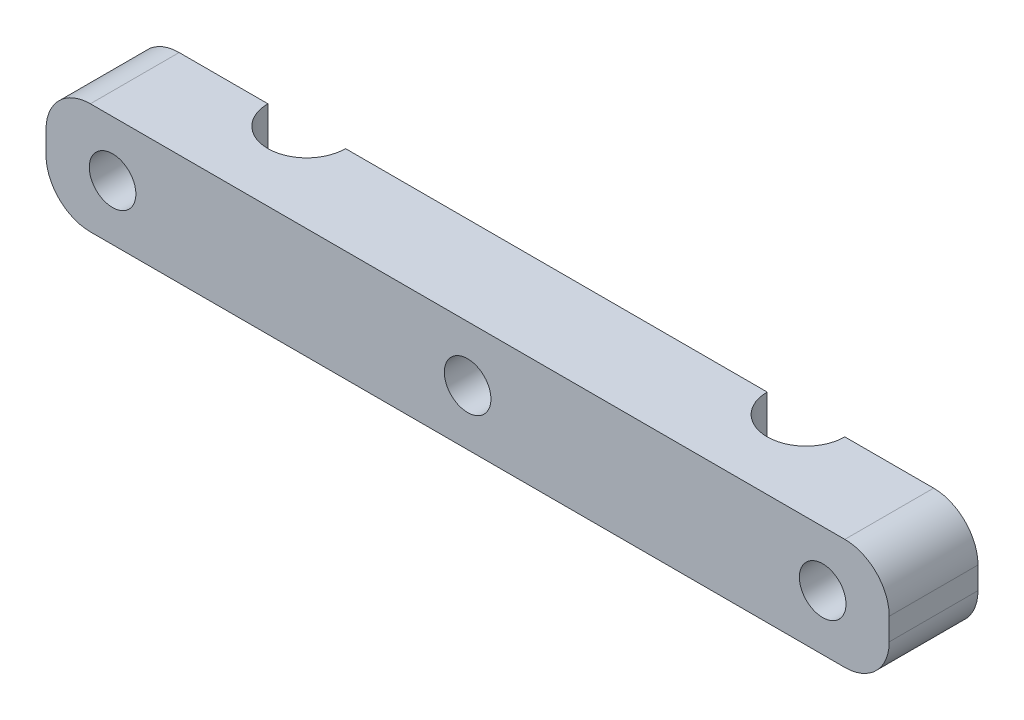
ISO-10303-21;
HEADER;
FILE_DESCRIPTION(('STEP AP214'),'2;1');
FILE_NAME('part.step','',(''),(''),'','','');
FILE_SCHEMA(('AUTOMOTIVE_DESIGN { 1 0 10303 214 1 1 1 1 }'));
ENDSEC;
DATA;
#1=APPLICATION_CONTEXT('core data for automotive mechanical design processes');
#2=APPLICATION_PROTOCOL_DEFINITION('international standard','automotive_design',2000,#1);
#3=PRODUCT_CONTEXT('',#1,'mechanical');
#4=PRODUCT('Part','Part','',(#3));
#5=PRODUCT_RELATED_PRODUCT_CATEGORY('part','',(#4));
#6=PRODUCT_DEFINITION_FORMATION('','',#4);
#7=PRODUCT_DEFINITION_CONTEXT('part definition',#1,'design');
#8=PRODUCT_DEFINITION('design','',#6,#7);
#9=PRODUCT_DEFINITION_SHAPE('','',#8);
#10=(LENGTH_UNIT() NAMED_UNIT(*) SI_UNIT(.MILLI.,.METRE.));
#11=(NAMED_UNIT(*) PLANE_ANGLE_UNIT() SI_UNIT($,.RADIAN.));
#12=(NAMED_UNIT(*) SI_UNIT($,.STERADIAN.) SOLID_ANGLE_UNIT());
#13=UNCERTAINTY_MEASURE_WITH_UNIT(LENGTH_MEASURE(1.E-05),#10,'distance_accuracy_value','');
#14=(GEOMETRIC_REPRESENTATION_CONTEXT(3) GLOBAL_UNCERTAINTY_ASSIGNED_CONTEXT((#13)) GLOBAL_UNIT_ASSIGNED_CONTEXT((#10,
#11,#12)) REPRESENTATION_CONTEXT('',''));
#15=CARTESIAN_POINT('',(0.,0.,0.));
#16=DIRECTION('',(0.,0.,1.));
#17=DIRECTION('',(1.,0.,0.));
#18=AXIS2_PLACEMENT_3D('',#15,#16,#17);
#19=CARTESIAN_POINT('',(-38.,10.,8.));
#20=DIRECTION('',(1.,0.,0.));
#21=DIRECTION('',(0.,0.,-1.));
#22=AXIS2_PLACEMENT_3D('',#19,#20,#21);
#23=PLANE('',#22);
#24=DIRECTION('',(0.,-1.,0.));
#25=VECTOR('',#24,1.);
#26=CARTESIAN_POINT('',(-38.,10.,0.));
#27=LINE('',#26,#25);
#28=CARTESIAN_POINT('',(-38.,6.,0.));
#29=VERTEX_POINT('',#28);
#30=CARTESIAN_POINT('',(-38.,4.,0.));
#31=VERTEX_POINT('',#30);
#32=EDGE_CURVE('E157',#29,#31,#27,.T.);
#33=ORIENTED_EDGE('',*,*,#32,.T.);
#34=DIRECTION('',(0.,0.,1.));
#35=VECTOR('',#34,1.);
#36=CARTESIAN_POINT('',(-38.,4.,8.));
#37=LINE('',#36,#35);
#38=CARTESIAN_POINT('',(-38.,4.,8.));
#39=VERTEX_POINT('',#38);
#40=EDGE_CURVE('E212',#31,#39,#37,.T.);
#41=ORIENTED_EDGE('',*,*,#40,.T.);
#42=DIRECTION('',(0.,-1.,0.));
#43=VECTOR('',#42,1.);
#44=CARTESIAN_POINT('',(-38.,10.,8.));
#45=LINE('',#44,#43);
#46=CARTESIAN_POINT('',(-38.,6.,8.));
#47=VERTEX_POINT('',#46);
#48=EDGE_CURVE('E183',#47,#39,#45,.T.);
#49=ORIENTED_EDGE('',*,*,#48,.F.);
#50=DIRECTION('',(0.,0.,1.));
#51=VECTOR('',#50,1.);
#52=CARTESIAN_POINT('',(-38.,6.,8.));
#53=LINE('',#52,#51);
#54=EDGE_CURVE('E52',#47,#29,#53,.F.);
#55=ORIENTED_EDGE('',*,*,#54,.T.);
#56=EDGE_LOOP('',(#33,#41,#49,#55));
#57=FACE_BOUND('',#56,.T.);
#58=ADVANCED_FACE('F32',(#57),#23,.F.);
#59=CARTESIAN_POINT('',(-38.,10.,8.));
#60=DIRECTION('',(0.,0.,-1.));
#61=DIRECTION('',(-1.,0.,0.));
#62=AXIS2_PLACEMENT_3D('',#59,#60,#61);
#63=PLANE('',#62);
#64=CARTESIAN_POINT('',(-32.,5.,8.));
#65=DIRECTION('',(0.,0.,-1.));
#66=DIRECTION('',(-1.,0.,0.));
#67=AXIS2_PLACEMENT_3D('',#64,#65,#66);
#68=CIRCLE('',#67,2.1);
#69=CARTESIAN_POINT('',(-34.1,5.,8.));
#70=VERTEX_POINT('',#69);
#71=EDGE_CURVE('E161',#70,#70,#68,.T.);
#72=ORIENTED_EDGE('',*,*,#71,.T.);
#73=EDGE_LOOP('',(#72));
#74=FACE_BOUND('',#73,.T.);
#75=CARTESIAN_POINT('',(0.,5.,8.));
#76=DIRECTION('',(0.,0.,-1.));
#77=DIRECTION('',(-1.,0.,0.));
#78=AXIS2_PLACEMENT_3D('',#75,#76,#77);
#79=CIRCLE('',#78,2.1);
#80=CARTESIAN_POINT('',(-2.1,5.,8.));
#81=VERTEX_POINT('',#80);
#82=EDGE_CURVE('E255',#81,#81,#79,.T.);
#83=ORIENTED_EDGE('',*,*,#82,.T.);
#84=EDGE_LOOP('',(#83));
#85=FACE_BOUND('',#84,.T.);
#86=CARTESIAN_POINT('',(32.,5.,8.));
#87=DIRECTION('',(0.,0.,-1.));
#88=DIRECTION('',(1.,0.,0.));
#89=AXIS2_PLACEMENT_3D('',#86,#87,#88);
#90=CIRCLE('',#89,2.1);
#91=CARTESIAN_POINT('',(34.1,5.,8.));
#92=VERTEX_POINT('',#91);
#93=EDGE_CURVE('E249',#92,#92,#90,.T.);
#94=ORIENTED_EDGE('',*,*,#93,.T.);
#95=EDGE_LOOP('',(#94));
#96=FACE_BOUND('',#95,.T.);
#97=DIRECTION('',(1.,0.,0.));
#98=VECTOR('',#97,1.);
#99=CARTESIAN_POINT('',(-38.,0.,8.));
#100=LINE('',#99,#98);
#101=CARTESIAN_POINT('',(-34.,0.,8.));
#102=VERTEX_POINT('',#101);
#103=CARTESIAN_POINT('',(34.,0.,8.));
#104=VERTEX_POINT('',#103);
#105=EDGE_CURVE('E158',#102,#104,#100,.T.);
#106=ORIENTED_EDGE('',*,*,#105,.T.);
#107=CARTESIAN_POINT('',(34.,4.,8.));
#108=DIRECTION('',(0.,0.,-1.));
#109=DIRECTION('',(-1.,0.,0.));
#110=AXIS2_PLACEMENT_3D('',#107,#108,#109);
#111=CIRCLE('',#110,4.);
#112=CARTESIAN_POINT('',(38.,4.,8.));
#113=VERTEX_POINT('',#112);
#114=EDGE_CURVE('E205',#104,#113,#111,.F.);
#115=ORIENTED_EDGE('',*,*,#114,.T.);
#116=DIRECTION('',(0.,-1.,0.));
#117=VECTOR('',#116,1.);
#118=CARTESIAN_POINT('',(38.,10.,8.));
#119=LINE('',#118,#117);
#120=CARTESIAN_POINT('',(38.,6.,8.));
#121=VERTEX_POINT('',#120);
#122=EDGE_CURVE('E180',#121,#113,#119,.T.);
#123=ORIENTED_EDGE('',*,*,#122,.F.);
#124=CARTESIAN_POINT('',(34.,6.,8.));
#125=DIRECTION('',(0.,0.,-1.));
#126=DIRECTION('',(-1.,0.,0.));
#127=AXIS2_PLACEMENT_3D('',#124,#125,#126);
#128=CIRCLE('',#127,4.);
#129=CARTESIAN_POINT('',(34.,10.,8.));
#130=VERTEX_POINT('',#129);
#131=EDGE_CURVE('E203',#121,#130,#128,.F.);
#132=ORIENTED_EDGE('',*,*,#131,.T.);
#133=DIRECTION('',(1.,0.,0.));
#134=VECTOR('',#133,1.);
#135=CARTESIAN_POINT('',(-38.,10.,8.));
#136=LINE('',#135,#134);
#137=CARTESIAN_POINT('',(-34.,10.,8.));
#138=VERTEX_POINT('',#137);
#139=EDGE_CURVE('E131',#138,#130,#136,.T.);
#140=ORIENTED_EDGE('',*,*,#139,.F.);
#141=CARTESIAN_POINT('',(-34.,6.,8.));
#142=DIRECTION('',(0.,0.,-1.));
#143=DIRECTION('',(-1.,0.,0.));
#144=AXIS2_PLACEMENT_3D('',#141,#142,#143);
#145=CIRCLE('',#144,4.);
#146=EDGE_CURVE('E199',#138,#47,#145,.F.);
#147=ORIENTED_EDGE('',*,*,#146,.T.);
#148=ORIENTED_EDGE('',*,*,#48,.T.);
#149=CARTESIAN_POINT('',(-34.,4.,8.));
#150=DIRECTION('',(0.,0.,-1.));
#151=DIRECTION('',(-1.,0.,0.));
#152=AXIS2_PLACEMENT_3D('',#149,#150,#151);
#153=CIRCLE('',#152,4.);
#154=EDGE_CURVE('E201',#39,#102,#153,.F.);
#155=ORIENTED_EDGE('',*,*,#154,.T.);
#156=EDGE_LOOP('',(#106,#115,#123,#132,#140,#147,#148,#155));
#157=FACE_BOUND('',#156,.T.);
#158=ADVANCED_FACE('F223',(#74,#85,#96,#157),#63,.F.);
#159=CARTESIAN_POINT('',(38.,10.,8.));
#160=DIRECTION('',(-1.,0.,0.));
#161=DIRECTION('',(0.,0.,1.));
#162=AXIS2_PLACEMENT_3D('',#159,#160,#161);
#163=PLANE('',#162);
#164=ORIENTED_EDGE('',*,*,#122,.T.);
#165=DIRECTION('',(0.,0.,-1.));
#166=VECTOR('',#165,1.);
#167=CARTESIAN_POINT('',(38.,4.,0.));
#168=LINE('',#167,#166);
#169=CARTESIAN_POINT('',(38.,4.,0.));
#170=VERTEX_POINT('',#169);
#171=EDGE_CURVE('E188',#113,#170,#168,.T.);
#172=ORIENTED_EDGE('',*,*,#171,.T.);
#173=DIRECTION('',(0.,-1.,0.));
#174=VECTOR('',#173,1.);
#175=CARTESIAN_POINT('',(38.,10.,0.));
#176=LINE('',#175,#174);
#177=CARTESIAN_POINT('',(38.,6.,0.));
#178=VERTEX_POINT('',#177);
#179=EDGE_CURVE('E141',#178,#170,#176,.T.);
#180=ORIENTED_EDGE('',*,*,#179,.F.);
#181=DIRECTION('',(0.,0.,-1.));
#182=VECTOR('',#181,1.);
#183=CARTESIAN_POINT('',(38.,6.,8.));
#184=LINE('',#183,#182);
#185=EDGE_CURVE('E186',#178,#121,#184,.F.);
#186=ORIENTED_EDGE('',*,*,#185,.T.);
#187=EDGE_LOOP('',(#164,#172,#180,#186));
#188=FACE_BOUND('',#187,.T.);
#189=ADVANCED_FACE('F240',(#188),#163,.F.);
#190=CARTESIAN_POINT('',(26.,10.,0.));
#191=DIRECTION('',(0.,0.,1.));
#192=DIRECTION('',(1.,0.,0.));
#193=AXIS2_PLACEMENT_3D('',#190,#191,#192);
#194=PLANE('',#193);
#195=CARTESIAN_POINT('',(32.,5.,0.));
#196=DIRECTION('',(0.,0.,-1.));
#197=DIRECTION('',(1.,0.,0.));
#198=AXIS2_PLACEMENT_3D('',#195,#196,#197);
#199=CIRCLE('',#198,2.1);
#200=CARTESIAN_POINT('',(34.1,5.,0.));
#201=VERTEX_POINT('',#200);
#202=EDGE_CURVE('E246',#201,#201,#199,.T.);
#203=ORIENTED_EDGE('',*,*,#202,.F.);
#204=EDGE_LOOP('',(#203));
#205=FACE_BOUND('',#204,.T.);
#206=ORIENTED_EDGE('',*,*,#179,.T.);
#207=CARTESIAN_POINT('',(34.,4.,0.));
#208=DIRECTION('',(0.,0.,1.));
#209=DIRECTION('',(1.,0.,0.));
#210=AXIS2_PLACEMENT_3D('',#207,#208,#209);
#211=CIRCLE('',#210,4.);
#212=CARTESIAN_POINT('',(34.,0.,0.));
#213=VERTEX_POINT('',#212);
#214=EDGE_CURVE('E193',#170,#213,#211,.F.);
#215=ORIENTED_EDGE('',*,*,#214,.T.);
#216=DIRECTION('',(-1.,0.,0.));
#217=VECTOR('',#216,1.);
#218=CARTESIAN_POINT('',(26.,0.,0.));
#219=LINE('',#218,#217);
#220=CARTESIAN_POINT('',(26.,0.,0.));
#221=VERTEX_POINT('',#220);
#222=EDGE_CURVE('E138',#213,#221,#219,.T.);
#223=ORIENTED_EDGE('',*,*,#222,.T.);
#224=DIRECTION('',(0.,-1.,0.));
#225=VECTOR('',#224,1.);
#226=CARTESIAN_POINT('',(26.,10.,0.));
#227=LINE('',#226,#225);
#228=CARTESIAN_POINT('',(26.,10.,0.));
#229=VERTEX_POINT('',#228);
#230=EDGE_CURVE('E134',#229,#221,#227,.T.);
#231=ORIENTED_EDGE('',*,*,#230,.F.);
#232=DIRECTION('',(-1.,0.,0.));
#233=VECTOR('',#232,1.);
#234=CARTESIAN_POINT('',(26.,10.,0.));
#235=LINE('',#234,#233);
#236=CARTESIAN_POINT('',(34.,10.,0.));
#237=VERTEX_POINT('',#236);
#238=EDGE_CURVE('E121',#237,#229,#235,.T.);
#239=ORIENTED_EDGE('',*,*,#238,.F.);
#240=CARTESIAN_POINT('',(34.,6.,0.));
#241=DIRECTION('',(0.,0.,1.));
#242=DIRECTION('',(1.,0.,0.));
#243=AXIS2_PLACEMENT_3D('',#240,#241,#242);
#244=CIRCLE('',#243,4.);
#245=EDGE_CURVE('E191',#237,#178,#244,.F.);
#246=ORIENTED_EDGE('',*,*,#245,.T.);
#247=EDGE_LOOP('',(#206,#215,#223,#231,#239,#246));
#248=FACE_BOUND('',#247,.T.);
#249=ADVANCED_FACE('F136',(#205,#248),#194,.F.);
#250=CARTESIAN_POINT('',(22.5,10.,0.));
#251=DIRECTION('',(0.,-1.,0.));
#252=DIRECTION('',(0.,0.,-1.));
#253=AXIS2_PLACEMENT_3D('',#250,#251,#252);
#254=CYLINDRICAL_SURFACE('',#253,3.5);
#255=CARTESIAN_POINT('',(22.5,0.,0.));
#256=DIRECTION('',(0.,-1.,0.));
#257=DIRECTION('',(0.,0.,1.));
#258=AXIS2_PLACEMENT_3D('',#255,#256,#257);
#259=CIRCLE('',#258,3.5);
#260=CARTESIAN_POINT('',(19.,0.,0.));
#261=VERTEX_POINT('',#260);
#262=EDGE_CURVE('E163',#221,#261,#259,.T.);
#263=ORIENTED_EDGE('',*,*,#262,.T.);
#264=DIRECTION('',(0.,-1.,0.));
#265=VECTOR('',#264,1.);
#266=CARTESIAN_POINT('',(19.,10.,0.));
#267=LINE('',#266,#265);
#268=CARTESIAN_POINT('',(19.,10.,0.));
#269=VERTEX_POINT('',#268);
#270=EDGE_CURVE('E142',#269,#261,#267,.T.);
#271=ORIENTED_EDGE('',*,*,#270,.F.);
#272=CARTESIAN_POINT('',(22.5,10.,0.));
#273=DIRECTION('',(0.,-1.,0.));
#274=DIRECTION('',(0.,0.,1.));
#275=AXIS2_PLACEMENT_3D('',#272,#273,#274);
#276=CIRCLE('',#275,3.5);
#277=EDGE_CURVE('E126',#229,#269,#276,.T.);
#278=ORIENTED_EDGE('',*,*,#277,.F.);
#279=ORIENTED_EDGE('',*,*,#230,.T.);
#280=EDGE_LOOP('',(#263,#271,#278,#279));
#281=FACE_BOUND('',#280,.T.);
#282=ADVANCED_FACE('F144',(#281),#254,.F.);
#283=CARTESIAN_POINT('',(-19.,10.,0.));
#284=DIRECTION('',(0.,0.,1.));
#285=DIRECTION('',(1.,0.,0.));
#286=AXIS2_PLACEMENT_3D('',#283,#284,#285);
#287=PLANE('',#286);
#288=CARTESIAN_POINT('',(0.,5.,0.));
#289=DIRECTION('',(0.,0.,-1.));
#290=DIRECTION('',(-1.,0.,0.));
#291=AXIS2_PLACEMENT_3D('',#288,#289,#290);
#292=CIRCLE('',#291,2.1);
#293=CARTESIAN_POINT('',(-2.1,5.,0.));
#294=VERTEX_POINT('',#293);
#295=EDGE_CURVE('E252',#294,#294,#292,.T.);
#296=ORIENTED_EDGE('',*,*,#295,.F.);
#297=EDGE_LOOP('',(#296));
#298=FACE_BOUND('',#297,.T.);
#299=DIRECTION('',(-1.,0.,0.));
#300=VECTOR('',#299,1.);
#301=CARTESIAN_POINT('',(-19.,0.,0.));
#302=LINE('',#301,#300);
#303=CARTESIAN_POINT('',(-19.,0.,0.));
#304=VERTEX_POINT('',#303);
#305=EDGE_CURVE('E165',#261,#304,#302,.T.);
#306=ORIENTED_EDGE('',*,*,#305,.T.);
#307=DIRECTION('',(0.,-1.,0.));
#308=VECTOR('',#307,1.);
#309=CARTESIAN_POINT('',(-19.,10.,0.));
#310=LINE('',#309,#308);
#311=CARTESIAN_POINT('',(-19.,10.,0.));
#312=VERTEX_POINT('',#311);
#313=EDGE_CURVE('E175',#312,#304,#310,.T.);
#314=ORIENTED_EDGE('',*,*,#313,.F.);
#315=DIRECTION('',(-1.,0.,0.));
#316=VECTOR('',#315,1.);
#317=CARTESIAN_POINT('',(-19.,10.,0.));
#318=LINE('',#317,#316);
#319=EDGE_CURVE('E147',#269,#312,#318,.T.);
#320=ORIENTED_EDGE('',*,*,#319,.F.);
#321=ORIENTED_EDGE('',*,*,#270,.T.);
#322=EDGE_LOOP('',(#306,#314,#320,#321));
#323=FACE_BOUND('',#322,.T.);
#324=ADVANCED_FACE('F281',(#298,#323),#287,.F.);
#325=CARTESIAN_POINT('',(-22.5,10.,0.));
#326=DIRECTION('',(0.,-1.,0.));
#327=DIRECTION('',(0.,0.,-1.));
#328=AXIS2_PLACEMENT_3D('',#325,#326,#327);
#329=CYLINDRICAL_SURFACE('',#328,3.5);
#330=CARTESIAN_POINT('',(-22.5,0.,0.));
#331=DIRECTION('',(0.,-1.,0.));
#332=DIRECTION('',(0.,0.,-1.));
#333=AXIS2_PLACEMENT_3D('',#330,#331,#332);
#334=CIRCLE('',#333,3.5);
#335=CARTESIAN_POINT('',(-26.,0.,0.));
#336=VERTEX_POINT('',#335);
#337=EDGE_CURVE('E167',#304,#336,#334,.T.);
#338=ORIENTED_EDGE('',*,*,#337,.T.);
#339=DIRECTION('',(0.,-1.,0.));
#340=VECTOR('',#339,1.);
#341=CARTESIAN_POINT('',(-26.,10.,0.));
#342=LINE('',#341,#340);
#343=CARTESIAN_POINT('',(-26.,10.,0.));
#344=VERTEX_POINT('',#343);
#345=EDGE_CURVE('E172',#344,#336,#342,.T.);
#346=ORIENTED_EDGE('',*,*,#345,.F.);
#347=CARTESIAN_POINT('',(-22.5,10.,0.));
#348=DIRECTION('',(0.,-1.,0.));
#349=DIRECTION('',(0.,0.,-1.));
#350=AXIS2_PLACEMENT_3D('',#347,#348,#349);
#351=CIRCLE('',#350,3.5);
#352=EDGE_CURVE('E149',#312,#344,#351,.T.);
#353=ORIENTED_EDGE('',*,*,#352,.F.);
#354=ORIENTED_EDGE('',*,*,#313,.T.);
#355=EDGE_LOOP('',(#338,#346,#353,#354));
#356=FACE_BOUND('',#355,.T.);
#357=ADVANCED_FACE('F274',(#356),#329,.F.);
#358=CARTESIAN_POINT('',(-38.,10.,0.));
#359=DIRECTION('',(0.,0.,1.));
#360=DIRECTION('',(1.,0.,0.));
#361=AXIS2_PLACEMENT_3D('',#358,#359,#360);
#362=PLANE('',#361);
#363=CARTESIAN_POINT('',(-32.,5.,0.));
#364=DIRECTION('',(0.,0.,-1.));
#365=DIRECTION('',(-1.,0.,0.));
#366=AXIS2_PLACEMENT_3D('',#363,#364,#365);
#367=CIRCLE('',#366,2.1);
#368=CARTESIAN_POINT('',(-34.1,5.,0.));
#369=VERTEX_POINT('',#368);
#370=EDGE_CURVE('E258',#369,#369,#367,.T.);
#371=ORIENTED_EDGE('',*,*,#370,.F.);
#372=EDGE_LOOP('',(#371));
#373=FACE_BOUND('',#372,.T.);
#374=DIRECTION('',(-1.,0.,0.));
#375=VECTOR('',#374,1.);
#376=CARTESIAN_POINT('',(-38.,0.,0.));
#377=LINE('',#376,#375);
#378=CARTESIAN_POINT('',(-34.,0.,0.));
#379=VERTEX_POINT('',#378);
#380=EDGE_CURVE('E169',#336,#379,#377,.T.);
#381=ORIENTED_EDGE('',*,*,#380,.T.);
#382=CARTESIAN_POINT('',(-34.,4.,0.));
#383=DIRECTION('',(0.,0.,1.));
#384=DIRECTION('',(1.,0.,0.));
#385=AXIS2_PLACEMENT_3D('',#382,#383,#384);
#386=CIRCLE('',#385,4.);
#387=EDGE_CURVE('E11',#379,#31,#386,.F.);
#388=ORIENTED_EDGE('',*,*,#387,.T.);
#389=ORIENTED_EDGE('',*,*,#32,.F.);
#390=CARTESIAN_POINT('',(-34.,6.,0.));
#391=DIRECTION('',(0.,0.,1.));
#392=DIRECTION('',(1.,0.,0.));
#393=AXIS2_PLACEMENT_3D('',#390,#391,#392);
#394=CIRCLE('',#393,4.);
#395=CARTESIAN_POINT('',(-34.,10.,0.));
#396=VERTEX_POINT('',#395);
#397=EDGE_CURVE('E40',#29,#396,#394,.F.);
#398=ORIENTED_EDGE('',*,*,#397,.T.);
#399=DIRECTION('',(-1.,0.,0.));
#400=VECTOR('',#399,1.);
#401=CARTESIAN_POINT('',(-38.,10.,0.));
#402=LINE('',#401,#400);
#403=EDGE_CURVE('E154',#344,#396,#402,.T.);
#404=ORIENTED_EDGE('',*,*,#403,.F.);
#405=ORIENTED_EDGE('',*,*,#345,.T.);
#406=EDGE_LOOP('',(#381,#388,#389,#398,#404,#405));
#407=FACE_BOUND('',#406,.T.);
#408=ADVANCED_FACE('F216',(#373,#407),#362,.F.);
#409=CARTESIAN_POINT('',(-22.5,10.,0.));
#410=DIRECTION('',(0.,-1.,0.));
#411=DIRECTION('',(0.,0.,-1.));
#412=AXIS2_PLACEMENT_3D('',#409,#410,#411);
#413=PLANE('',#412);
#414=ORIENTED_EDGE('',*,*,#139,.T.);
#415=DIRECTION('',(0.,0.,-1.));
#416=VECTOR('',#415,1.);
#417=CARTESIAN_POINT('',(34.,10.,0.));
#418=LINE('',#417,#416);
#419=EDGE_CURVE('E129',#130,#237,#418,.T.);
#420=ORIENTED_EDGE('',*,*,#419,.T.);
#421=ORIENTED_EDGE('',*,*,#238,.T.);
#422=ORIENTED_EDGE('',*,*,#277,.T.);
#423=ORIENTED_EDGE('',*,*,#319,.T.);
#424=ORIENTED_EDGE('',*,*,#352,.T.);
#425=ORIENTED_EDGE('',*,*,#403,.T.);
#426=DIRECTION('',(0.,0.,1.));
#427=VECTOR('',#426,1.);
#428=CARTESIAN_POINT('',(-34.,10.,0.));
#429=LINE('',#428,#427);
#430=EDGE_CURVE('E207',#396,#138,#429,.T.);
#431=ORIENTED_EDGE('',*,*,#430,.T.);
#432=EDGE_LOOP('',(#414,#420,#421,#422,#423,#424,#425,#431));
#433=FACE_BOUND('',#432,.T.);
#434=ADVANCED_FACE('F124',(#433),#413,.F.);
#435=CARTESIAN_POINT('',(-22.5,0.,0.));
#436=DIRECTION('',(0.,-1.,0.));
#437=DIRECTION('',(0.,0.,-1.));
#438=AXIS2_PLACEMENT_3D('',#435,#436,#437);
#439=PLANE('',#438);
#440=ORIENTED_EDGE('',*,*,#222,.F.);
#441=DIRECTION('',(0.,0.,-1.));
#442=VECTOR('',#441,1.);
#443=CARTESIAN_POINT('',(34.,0.,8.));
#444=LINE('',#443,#442);
#445=EDGE_CURVE('E197',#213,#104,#444,.F.);
#446=ORIENTED_EDGE('',*,*,#445,.T.);
#447=ORIENTED_EDGE('',*,*,#105,.F.);
#448=DIRECTION('',(0.,0.,1.));
#449=VECTOR('',#448,1.);
#450=CARTESIAN_POINT('',(-34.,0.,0.));
#451=LINE('',#450,#449);
#452=EDGE_CURVE('E195',#102,#379,#451,.F.);
#453=ORIENTED_EDGE('',*,*,#452,.T.);
#454=ORIENTED_EDGE('',*,*,#380,.F.);
#455=ORIENTED_EDGE('',*,*,#337,.F.);
#456=ORIENTED_EDGE('',*,*,#305,.F.);
#457=ORIENTED_EDGE('',*,*,#262,.F.);
#458=EDGE_LOOP('',(#440,#446,#447,#453,#454,#455,#456,#457));
#459=FACE_BOUND('',#458,.T.);
#460=ADVANCED_FACE('F231',(#459),#439,.T.);
#461=CARTESIAN_POINT('',(-32.,5.,8.));
#462=DIRECTION('',(0.,0.,-1.));
#463=DIRECTION('',(-1.,0.,0.));
#464=AXIS2_PLACEMENT_3D('',#461,#462,#463);
#465=CYLINDRICAL_SURFACE('',#464,2.1);
#466=ORIENTED_EDGE('',*,*,#71,.F.);
#467=EDGE_LOOP('',(#466));
#468=FACE_BOUND('',#467,.T.);
#469=ORIENTED_EDGE('',*,*,#370,.T.);
#470=EDGE_LOOP('',(#469));
#471=FACE_BOUND('',#470,.T.);
#472=ADVANCED_FACE('F266',(#468,#471),#465,.F.);
#473=CARTESIAN_POINT('',(0.,5.,8.));
#474=DIRECTION('',(0.,0.,-1.));
#475=DIRECTION('',(-1.,0.,0.));
#476=AXIS2_PLACEMENT_3D('',#473,#474,#475);
#477=CYLINDRICAL_SURFACE('',#476,2.1);
#478=ORIENTED_EDGE('',*,*,#82,.F.);
#479=EDGE_LOOP('',(#478));
#480=FACE_BOUND('',#479,.T.);
#481=ORIENTED_EDGE('',*,*,#295,.T.);
#482=EDGE_LOOP('',(#481));
#483=FACE_BOUND('',#482,.T.);
#484=ADVANCED_FACE('F269',(#480,#483),#477,.F.);
#485=CARTESIAN_POINT('',(32.,5.,8.));
#486=DIRECTION('',(0.,0.,-1.));
#487=DIRECTION('',(-1.,0.,0.));
#488=AXIS2_PLACEMENT_3D('',#485,#486,#487);
#489=CYLINDRICAL_SURFACE('',#488,2.1);
#490=ORIENTED_EDGE('',*,*,#93,.F.);
#491=EDGE_LOOP('',(#490));
#492=FACE_BOUND('',#491,.T.);
#493=ORIENTED_EDGE('',*,*,#202,.T.);
#494=EDGE_LOOP('',(#493));
#495=FACE_BOUND('',#494,.T.);
#496=ADVANCED_FACE('F295',(#492,#495),#489,.F.);
#497=CARTESIAN_POINT('',(34.,4.,8.));
#498=DIRECTION('',(0.,0.,1.));
#499=DIRECTION('',(1.,0.,0.));
#500=AXIS2_PLACEMENT_3D('',#497,#498,#499);
#501=CYLINDRICAL_SURFACE('',#500,4.);
#502=ORIENTED_EDGE('',*,*,#114,.F.);
#503=ORIENTED_EDGE('',*,*,#445,.F.);
#504=ORIENTED_EDGE('',*,*,#214,.F.);
#505=ORIENTED_EDGE('',*,*,#171,.F.);
#506=EDGE_LOOP('',(#502,#503,#504,#505));
#507=FACE_BOUND('',#506,.T.);
#508=ADVANCED_FACE('F235',(#507),#501,.T.);
#509=CARTESIAN_POINT('',(34.,6.,0.));
#510=DIRECTION('',(0.,0.,-1.));
#511=DIRECTION('',(-1.,0.,0.));
#512=AXIS2_PLACEMENT_3D('',#509,#510,#511);
#513=CYLINDRICAL_SURFACE('',#512,4.);
#514=ORIENTED_EDGE('',*,*,#131,.F.);
#515=ORIENTED_EDGE('',*,*,#185,.F.);
#516=ORIENTED_EDGE('',*,*,#245,.F.);
#517=ORIENTED_EDGE('',*,*,#419,.F.);
#518=EDGE_LOOP('',(#514,#515,#516,#517));
#519=FACE_BOUND('',#518,.T.);
#520=ADVANCED_FACE('F244',(#519),#513,.T.);
#521=CARTESIAN_POINT('',(-34.,4.,8.));
#522=DIRECTION('',(0.,0.,-1.));
#523=DIRECTION('',(-1.,0.,0.));
#524=AXIS2_PLACEMENT_3D('',#521,#522,#523);
#525=CYLINDRICAL_SURFACE('',#524,4.);
#526=ORIENTED_EDGE('',*,*,#387,.F.);
#527=ORIENTED_EDGE('',*,*,#452,.F.);
#528=ORIENTED_EDGE('',*,*,#154,.F.);
#529=ORIENTED_EDGE('',*,*,#40,.F.);
#530=EDGE_LOOP('',(#526,#527,#528,#529));
#531=FACE_BOUND('',#530,.T.);
#532=ADVANCED_FACE('F226',(#531),#525,.T.);
#533=CARTESIAN_POINT('',(-34.,6.,0.));
#534=DIRECTION('',(0.,0.,1.));
#535=DIRECTION('',(1.,0.,0.));
#536=AXIS2_PLACEMENT_3D('',#533,#534,#535);
#537=CYLINDRICAL_SURFACE('',#536,4.);
#538=ORIENTED_EDGE('',*,*,#397,.F.);
#539=ORIENTED_EDGE('',*,*,#54,.F.);
#540=ORIENTED_EDGE('',*,*,#146,.F.);
#541=ORIENTED_EDGE('',*,*,#430,.F.);
#542=EDGE_LOOP('',(#538,#539,#540,#541));
#543=FACE_BOUND('',#542,.T.);
#544=ADVANCED_FACE('F34',(#543),#537,.T.);
#545=CLOSED_SHELL('',(#58,#158,#189,#249,#282,#324,#357,#408,#434,#460,#472,#484,#496,#508,#520,
#532,#544));
#546=MANIFOLD_SOLID_BREP('B2',#545);
#547=ADVANCED_BREP_SHAPE_REPRESENTATION('',(#18,#546),#14);
#548=SHAPE_DEFINITION_REPRESENTATION(#9,#547);
ENDSEC;
END-ISO-10303-21;
